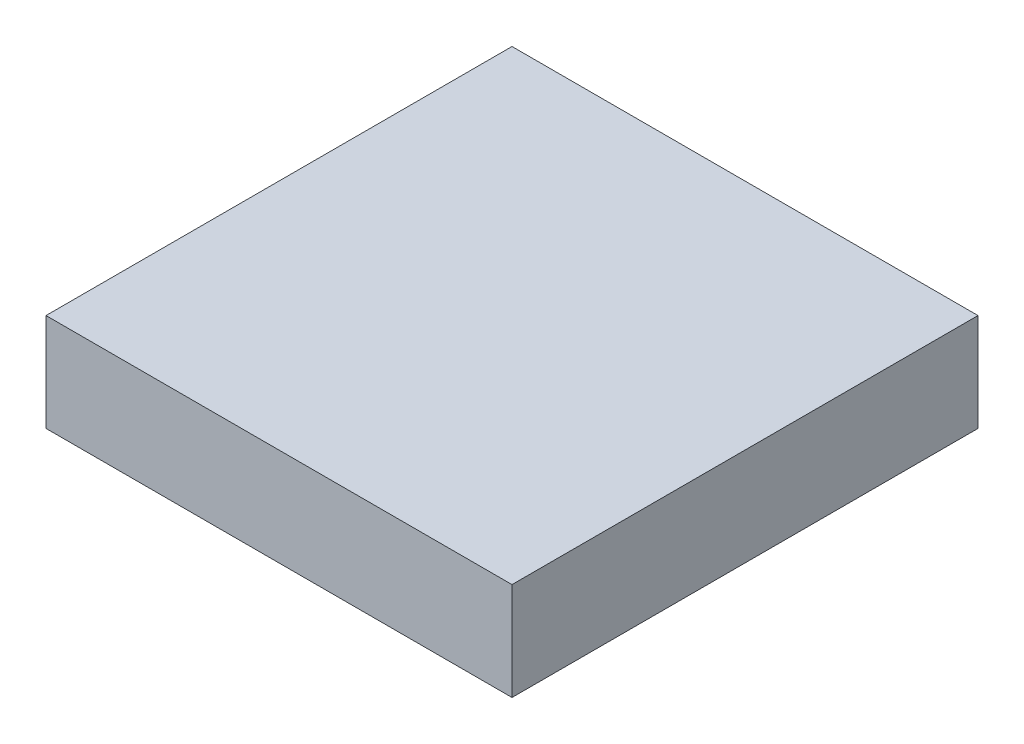
ISO-10303-21;
HEADER;
FILE_DESCRIPTION(('STEP AP214'),'2;1');
FILE_NAME('part.step','',(''),(''),'','','');
FILE_SCHEMA(('AUTOMOTIVE_DESIGN { 1 0 10303 214 1 1 1 1 }'));
ENDSEC;
DATA;
#1=APPLICATION_CONTEXT('core data for automotive mechanical design processes');
#2=APPLICATION_PROTOCOL_DEFINITION('international standard','automotive_design',2000,#1);
#3=PRODUCT_CONTEXT('',#1,'mechanical');
#4=PRODUCT('Part','Part','',(#3));
#5=PRODUCT_RELATED_PRODUCT_CATEGORY('part','',(#4));
#6=PRODUCT_DEFINITION_FORMATION('','',#4);
#7=PRODUCT_DEFINITION_CONTEXT('part definition',#1,'design');
#8=PRODUCT_DEFINITION('design','',#6,#7);
#9=PRODUCT_DEFINITION_SHAPE('','',#8);
#10=(LENGTH_UNIT() NAMED_UNIT(*) SI_UNIT(.MILLI.,.METRE.));
#11=(NAMED_UNIT(*) PLANE_ANGLE_UNIT() SI_UNIT($,.RADIAN.));
#12=(NAMED_UNIT(*) SI_UNIT($,.STERADIAN.) SOLID_ANGLE_UNIT());
#13=UNCERTAINTY_MEASURE_WITH_UNIT(LENGTH_MEASURE(1.E-05),#10,'distance_accuracy_value','');
#14=(GEOMETRIC_REPRESENTATION_CONTEXT(3) GLOBAL_UNCERTAINTY_ASSIGNED_CONTEXT((#13)) GLOBAL_UNIT_ASSIGNED_CONTEXT((#10,
#11,#12)) REPRESENTATION_CONTEXT('',''));
#15=CARTESIAN_POINT('',(0.,0.,0.));
#16=DIRECTION('',(0.,0.,1.));
#17=DIRECTION('',(1.,0.,0.));
#18=AXIS2_PLACEMENT_3D('',#15,#16,#17);
#19=CARTESIAN_POINT('',(0.,35.7124,0.));
#20=DIRECTION('',(1.,0.,0.));
#21=DIRECTION('',(0.,0.,-1.));
#22=AXIS2_PLACEMENT_3D('',#19,#20,#21);
#23=PLANE('',#22);
#24=DIRECTION('',(0.,0.,1.));
#25=VECTOR('',#24,1.);
#26=CARTESIAN_POINT('',(0.,0.,0.));
#27=LINE('',#26,#25);
#28=CARTESIAN_POINT('',(0.,0.,-170.18));
#29=VERTEX_POINT('',#28);
#30=CARTESIAN_POINT('',(0.,0.,0.));
#31=VERTEX_POINT('',#30);
#32=EDGE_CURVE('E96',#29,#31,#27,.T.);
#33=ORIENTED_EDGE('',*,*,#32,.T.);
#34=DIRECTION('',(0.,-1.,0.));
#35=VECTOR('',#34,1.);
#36=CARTESIAN_POINT('',(0.,35.7124,0.));
#37=LINE('',#36,#35);
#38=CARTESIAN_POINT('',(0.,35.7124,0.));
#39=VERTEX_POINT('',#38);
#40=EDGE_CURVE('E11',#39,#31,#37,.T.);
#41=ORIENTED_EDGE('',*,*,#40,.F.);
#42=DIRECTION('',(0.,0.,1.));
#43=VECTOR('',#42,1.);
#44=CARTESIAN_POINT('',(0.,35.7124,0.));
#45=LINE('',#44,#43);
#46=CARTESIAN_POINT('',(0.,35.7124,-170.18));
#47=VERTEX_POINT('',#46);
#48=EDGE_CURVE('E84',#47,#39,#45,.T.);
#49=ORIENTED_EDGE('',*,*,#48,.F.);
#50=DIRECTION('',(0.,-1.,0.));
#51=VECTOR('',#50,1.);
#52=CARTESIAN_POINT('',(0.,35.7124,-170.18));
#53=LINE('',#52,#51);
#54=EDGE_CURVE('E92',#47,#29,#53,.T.);
#55=ORIENTED_EDGE('',*,*,#54,.T.);
#56=EDGE_LOOP('',(#33,#41,#49,#55));
#57=FACE_BOUND('',#56,.T.);
#58=ADVANCED_FACE('F33',(#57),#23,.F.);
#59=CARTESIAN_POINT('',(0.,35.7124,0.));
#60=DIRECTION('',(0.,0.,-1.));
#61=DIRECTION('',(-1.,0.,0.));
#62=AXIS2_PLACEMENT_3D('',#59,#60,#61);
#63=PLANE('',#62);
#64=DIRECTION('',(1.,0.,0.));
#65=VECTOR('',#64,1.);
#66=CARTESIAN_POINT('',(0.,0.,0.));
#67=LINE('',#66,#65);
#68=CARTESIAN_POINT('',(170.18,0.,0.));
#69=VERTEX_POINT('',#68);
#70=EDGE_CURVE('E88',#31,#69,#67,.T.);
#71=ORIENTED_EDGE('',*,*,#70,.T.);
#72=DIRECTION('',(0.,-1.,0.));
#73=VECTOR('',#72,1.);
#74=CARTESIAN_POINT('',(170.18,35.7124,0.));
#75=LINE('',#74,#73);
#76=CARTESIAN_POINT('',(170.18,35.7124,0.));
#77=VERTEX_POINT('',#76);
#78=EDGE_CURVE('E41',#77,#69,#75,.T.);
#79=ORIENTED_EDGE('',*,*,#78,.F.);
#80=DIRECTION('',(1.,0.,0.));
#81=VECTOR('',#80,1.);
#82=CARTESIAN_POINT('',(0.,35.7124,0.));
#83=LINE('',#82,#81);
#84=EDGE_CURVE('E79',#39,#77,#83,.T.);
#85=ORIENTED_EDGE('',*,*,#84,.F.);
#86=ORIENTED_EDGE('',*,*,#40,.T.);
#87=EDGE_LOOP('',(#71,#79,#85,#86));
#88=FACE_BOUND('',#87,.T.);
#89=ADVANCED_FACE('F87',(#88),#63,.F.);
#90=CARTESIAN_POINT('',(170.18,35.7124,0.));
#91=DIRECTION('',(-1.,0.,0.));
#92=DIRECTION('',(0.,0.,1.));
#93=AXIS2_PLACEMENT_3D('',#90,#91,#92);
#94=PLANE('',#93);
#95=DIRECTION('',(0.,0.,-1.));
#96=VECTOR('',#95,1.);
#97=CARTESIAN_POINT('',(170.18,0.,0.));
#98=LINE('',#97,#96);
#99=CARTESIAN_POINT('',(170.18,0.,-170.18));
#100=VERTEX_POINT('',#99);
#101=EDGE_CURVE('E66',#69,#100,#98,.T.);
#102=ORIENTED_EDGE('',*,*,#101,.T.);
#103=DIRECTION('',(0.,-1.,0.));
#104=VECTOR('',#103,1.);
#105=CARTESIAN_POINT('',(170.18,35.7124,-170.18));
#106=LINE('',#105,#104);
#107=CARTESIAN_POINT('',(170.18,35.7124,-170.18));
#108=VERTEX_POINT('',#107);
#109=EDGE_CURVE('E89',#108,#100,#106,.T.);
#110=ORIENTED_EDGE('',*,*,#109,.F.);
#111=DIRECTION('',(0.,0.,-1.));
#112=VECTOR('',#111,1.);
#113=CARTESIAN_POINT('',(170.18,35.7124,0.));
#114=LINE('',#113,#112);
#115=EDGE_CURVE('E82',#77,#108,#114,.T.);
#116=ORIENTED_EDGE('',*,*,#115,.F.);
#117=ORIENTED_EDGE('',*,*,#78,.T.);
#118=EDGE_LOOP('',(#102,#110,#116,#117));
#119=FACE_BOUND('',#118,.T.);
#120=ADVANCED_FACE('F90',(#119),#94,.F.);
#121=CARTESIAN_POINT('',(0.,35.7124,-170.18));
#122=DIRECTION('',(0.,0.,1.));
#123=DIRECTION('',(1.,0.,0.));
#124=AXIS2_PLACEMENT_3D('',#121,#122,#123);
#125=PLANE('',#124);
#126=DIRECTION('',(-1.,0.,0.));
#127=VECTOR('',#126,1.);
#128=CARTESIAN_POINT('',(0.,0.,-170.18));
#129=LINE('',#128,#127);
#130=EDGE_CURVE('E72',#100,#29,#129,.T.);
#131=ORIENTED_EDGE('',*,*,#130,.T.);
#132=ORIENTED_EDGE('',*,*,#54,.F.);
#133=DIRECTION('',(-1.,0.,0.));
#134=VECTOR('',#133,1.);
#135=CARTESIAN_POINT('',(0.,35.7124,-170.18));
#136=LINE('',#135,#134);
#137=EDGE_CURVE('E49',#108,#47,#136,.T.);
#138=ORIENTED_EDGE('',*,*,#137,.F.);
#139=ORIENTED_EDGE('',*,*,#109,.T.);
#140=EDGE_LOOP('',(#131,#132,#138,#139));
#141=FACE_BOUND('',#140,.T.);
#142=ADVANCED_FACE('F103',(#141),#125,.F.);
#143=CARTESIAN_POINT('',(0.,35.7124,0.));
#144=DIRECTION('',(0.,-1.,0.));
#145=DIRECTION('',(0.,0.,-1.));
#146=AXIS2_PLACEMENT_3D('',#143,#144,#145);
#147=PLANE('',#146);
#148=ORIENTED_EDGE('',*,*,#48,.T.);
#149=ORIENTED_EDGE('',*,*,#84,.T.);
#150=ORIENTED_EDGE('',*,*,#115,.T.);
#151=ORIENTED_EDGE('',*,*,#137,.T.);
#152=EDGE_LOOP('',(#148,#149,#150,#151));
#153=FACE_BOUND('',#152,.T.);
#154=ADVANCED_FACE('F80',(#153),#147,.F.);
#155=CARTESIAN_POINT('',(0.,0.,0.));
#156=DIRECTION('',(0.,-1.,0.));
#157=DIRECTION('',(0.,0.,-1.));
#158=AXIS2_PLACEMENT_3D('',#155,#156,#157);
#159=PLANE('',#158);
#160=ORIENTED_EDGE('',*,*,#32,.F.);
#161=ORIENTED_EDGE('',*,*,#130,.F.);
#162=ORIENTED_EDGE('',*,*,#101,.F.);
#163=ORIENTED_EDGE('',*,*,#70,.F.);
#164=EDGE_LOOP('',(#160,#161,#162,#163));
#165=FACE_BOUND('',#164,.T.);
#166=ADVANCED_FACE('F106',(#165),#159,.T.);
#167=CLOSED_SHELL('',(#58,#89,#120,#142,#154,#166));
#168=MANIFOLD_SOLID_BREP('B2',#167);
#169=ADVANCED_BREP_SHAPE_REPRESENTATION('',(#18,#168),#14);
#170=SHAPE_DEFINITION_REPRESENTATION(#9,#169);
ENDSEC;
END-ISO-10303-21;
